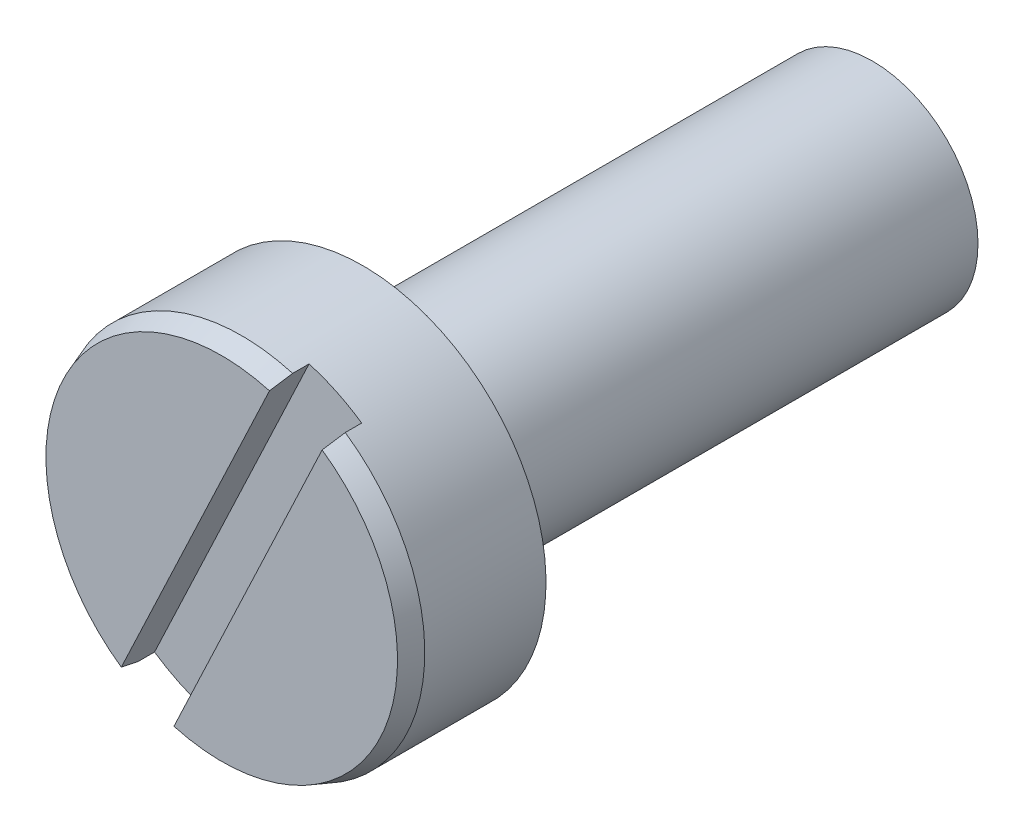
ISO-10303-21;
HEADER;
FILE_DESCRIPTION(('STEP AP214'),'2;1');
FILE_NAME('part.step','',(''),(''),'','','');
FILE_SCHEMA(('AUTOMOTIVE_DESIGN { 1 0 10303 214 1 1 1 1 }'));
ENDSEC;
DATA;
#1=APPLICATION_CONTEXT('core data for automotive mechanical design processes');
#2=APPLICATION_PROTOCOL_DEFINITION('international standard','automotive_design',2000,#1);
#3=PRODUCT_CONTEXT('',#1,'mechanical');
#4=PRODUCT('Part','Part','',(#3));
#5=PRODUCT_RELATED_PRODUCT_CATEGORY('part','',(#4));
#6=PRODUCT_DEFINITION_FORMATION('','',#4);
#7=PRODUCT_DEFINITION_CONTEXT('part definition',#1,'design');
#8=PRODUCT_DEFINITION('design','',#6,#7);
#9=PRODUCT_DEFINITION_SHAPE('','',#8);
#10=(LENGTH_UNIT() NAMED_UNIT(*) SI_UNIT(.MILLI.,.METRE.));
#11=(NAMED_UNIT(*) PLANE_ANGLE_UNIT() SI_UNIT($,.RADIAN.));
#12=(NAMED_UNIT(*) SI_UNIT($,.STERADIAN.) SOLID_ANGLE_UNIT());
#13=UNCERTAINTY_MEASURE_WITH_UNIT(LENGTH_MEASURE(1.E-05),#10,'distance_accuracy_value','');
#14=(GEOMETRIC_REPRESENTATION_CONTEXT(3) GLOBAL_UNCERTAINTY_ASSIGNED_CONTEXT((#13)) GLOBAL_UNIT_ASSIGNED_CONTEXT((#10,
#11,#12)) REPRESENTATION_CONTEXT('',''));
#15=CARTESIAN_POINT('',(0.,0.,0.));
#16=DIRECTION('',(0.,0.,1.));
#17=DIRECTION('',(1.,0.,0.));
#18=AXIS2_PLACEMENT_3D('',#15,#16,#17);
#19=CARTESIAN_POINT('',(15.2521980967912,-23.3190409170735,19.8000000000005));
#20=DIRECTION('',(0.,0.,-1.));
#21=DIRECTION('',(0.427457329703379,0.904035525453982,0.));
#22=AXIS2_PLACEMENT_3D('',#19,#20,#21);
#23=TOROIDAL_SURFACE('',#22,1.95,0.5);
#24=CARTESIAN_POINT('',(15.2521980967912,-23.3190409170735,19.8000000000005));
#25=DIRECTION('',(0.,0.,-1.));
#26=DIRECTION('',(0.427457329703379,0.904035525453982,0.));
#27=AXIS2_PLACEMENT_3D('',#24,#25,#26);
#28=CIRCLE('',#27,1.45);
#29=CARTESIAN_POINT('',(15.8720112248611,-22.0081894051652,19.8000000000005));
#30=VERTEX_POINT('',#29);
#31=EDGE_CURVE('E11',#30,#30,#28,.T.);
#32=ORIENTED_EDGE('',*,*,#31,.F.);
#33=EDGE_LOOP('',(#32));
#34=FACE_BOUND('',#33,.T.);
#35=CARTESIAN_POINT('',(15.2521980967912,-23.3190409170728,20.3000000000005));
#36=DIRECTION('',(0.,0.,1.));
#37=DIRECTION('',(0.427457329703379,0.904035525453982,0.));
#38=AXIS2_PLACEMENT_3D('',#35,#36,#37);
#39=CIRCLE('',#38,1.95);
#40=CARTESIAN_POINT('',(16.0857398897128,-21.5561716424375,20.3000000000005));
#41=VERTEX_POINT('',#40);
#42=EDGE_CURVE('E125',#41,#41,#39,.T.);
#43=ORIENTED_EDGE('',*,*,#42,.F.);
#44=EDGE_LOOP('',(#43));
#45=FACE_BOUND('',#44,.T.);
#46=ADVANCED_FACE('F17',(#34,#45),#23,.F.);
#47=CARTESIAN_POINT('',(15.2521980967912,-23.3190409170726,13.3000000000005));
#48=DIRECTION('',(0.,0.,1.));
#49=DIRECTION('',(-0.427457329703379,-0.904035525453982,0.));
#50=AXIS2_PLACEMENT_3D('',#47,#48,#49);
#51=CONICAL_SURFACE('',#50,1.175252258055,1.221730476396);
#52=CARTESIAN_POINT('',(15.2521980967912,-23.3190409170726,13.3000000000005));
#53=DIRECTION('',(0.,0.,-1.));
#54=DIRECTION('',(0.427457329703379,0.904035525453982,0.));
#55=AXIS2_PLACEMENT_3D('',#52,#53,#54);
#56=CIRCLE('',#55,1.175252258055);
#57=CARTESIAN_POINT('',(15.7545682887473,-22.2565711244209,13.3000000000005));
#58=VERTEX_POINT('',#57);
#59=EDGE_CURVE('E110',#58,#58,#56,.T.);
#60=ORIENTED_EDGE('',*,*,#59,.F.);
#61=EDGE_LOOP('',(#60));
#62=FACE_BOUND('',#61,.T.);
#63=CARTESIAN_POINT('',(15.2521980967912,-23.3190409170735,13.4000000000005));
#64=DIRECTION('',(0.,0.,1.));
#65=DIRECTION('',(0.427457329703379,0.904035525453982,0.));
#66=AXIS2_PLACEMENT_3D('',#63,#64,#65);
#67=CIRCLE('',#66,1.45);
#68=CARTESIAN_POINT('',(15.8720112248611,-22.0081894051652,13.4000000000005));
#69=VERTEX_POINT('',#68);
#70=EDGE_CURVE('E26',#69,#69,#67,.T.);
#71=ORIENTED_EDGE('',*,*,#70,.F.);
#72=EDGE_LOOP('',(#71));
#73=FACE_BOUND('',#72,.T.);
#74=ADVANCED_FACE('F181',(#62,#73),#51,.T.);
#75=CARTESIAN_POINT('',(15.2521980967912,-23.3190409170728,20.3000000000005));
#76=DIRECTION('',(0.,0.,1.));
#77=DIRECTION('',(-0.427457329703379,-0.904035525453982,0.));
#78=AXIS2_PLACEMENT_3D('',#75,#76,#77);
#79=CONICAL_SURFACE('',#78,2.240252258055,1.221730476396);
#80=CARTESIAN_POINT('',(15.2521980967912,-23.3190409170728,20.3000000000005));
#81=DIRECTION('',(0.,0.,-1.));
#82=DIRECTION('',(0.427457329703379,0.904035525453982,0.));
#83=AXIS2_PLACEMENT_3D('',#80,#81,#82);
#84=CIRCLE('',#83,2.240252258055);
#85=CARTESIAN_POINT('',(16.2098103448814,-21.2937732898126,20.3000000000005));
#86=VERTEX_POINT('',#85);
#87=EDGE_CURVE('E121',#86,#86,#84,.T.);
#88=ORIENTED_EDGE('',*,*,#87,.F.);
#89=EDGE_LOOP('',(#88));
#90=FACE_BOUND('',#89,.T.);
#91=CARTESIAN_POINT('',(15.2521980967912,-23.3190409170726,20.4000000000005));
#92=DIRECTION('',(0.,0.,1.));
#93=DIRECTION('',(0.427457329703379,0.904035525453982,0.));
#94=AXIS2_PLACEMENT_3D('',#91,#92,#93);
#95=CIRCLE('',#94,2.515);
#96=CARTESIAN_POINT('',(16.3272532809952,-21.0453915705559,20.4000000000005));
#97=VERTEX_POINT('',#96);
#98=EDGE_CURVE('E68',#97,#97,#95,.T.);
#99=ORIENTED_EDGE('',*,*,#98,.F.);
#100=EDGE_LOOP('',(#99));
#101=FACE_BOUND('',#100,.T.);
#102=ADVANCED_FACE('F186',(#90,#101),#79,.T.);
#103=CARTESIAN_POINT('',(15.2521980967912,-23.3190409170726,13.3000000000005));
#104=DIRECTION('',(0.,0.,-1.));
#105=DIRECTION('',(0.427457329703379,0.904035525453982,0.));
#106=AXIS2_PLACEMENT_3D('',#103,#104,#105);
#107=CYLINDRICAL_SURFACE('',#106,1.45);
#108=ORIENTED_EDGE('',*,*,#31,.T.);
#109=EDGE_LOOP('',(#108));
#110=FACE_BOUND('',#109,.T.);
#111=ORIENTED_EDGE('',*,*,#70,.T.);
#112=EDGE_LOOP('',(#111));
#113=FACE_BOUND('',#112,.T.);
#114=ADVANCED_FACE('F174',(#110,#113),#107,.T.);
#115=CARTESIAN_POINT('',(15.2521980967912,-23.3190409170726,13.3000000000005));
#116=DIRECTION('',(0.,0.,-1.));
#117=DIRECTION('',(0.427457329703379,0.904035525453982,0.));
#118=AXIS2_PLACEMENT_3D('',#115,#116,#117);
#119=CYLINDRICAL_SURFACE('',#118,2.515);
#120=CARTESIAN_POINT('',(15.2521980967912,-23.3190409170732,21.8400000000005));
#121=DIRECTION('',(0.,0.,-1.));
#122=DIRECTION('',(-0.427457329703369,-0.904035525453986,0.));
#123=AXIS2_PLACEMENT_3D('',#120,#121,#122);
#124=CIRCLE('',#123,2.515);
#125=CARTESIAN_POINT('',(14.5524412662482,-25.7347324077461,21.8400000000006));
#126=VERTEX_POINT('',#125);
#127=CARTESIAN_POINT('',(13.8292128458852,-25.3927665439834,21.8400000000006));
#128=VERTEX_POINT('',#127);
#129=EDGE_CURVE('E145',#126,#128,#124,.T.);
#130=ORIENTED_EDGE('',*,*,#129,.T.);
#131=DIRECTION('',(0.,0.,-1.));
#132=VECTOR('',#131,1.);
#133=CARTESIAN_POINT('',(13.8292128458852,-25.3927665439833,13.3000000000005));
#134=LINE('',#133,#132);
#135=CARTESIAN_POINT('',(13.8292128458852,-25.3927665439834,22.0652522580556));
#136=VERTEX_POINT('',#135);
#137=EDGE_CURVE('E64',#136,#128,#134,.T.);
#138=ORIENTED_EDGE('',*,*,#137,.F.);
#139=CARTESIAN_POINT('',(15.2521980967912,-23.3190409170731,22.0652522580555));
#140=DIRECTION('',(0.,0.,-1.));
#141=DIRECTION('',(-0.427457329703379,-0.904035525453982,0.));
#142=AXIS2_PLACEMENT_3D('',#139,#140,#141);
#143=CIRCLE('',#142,2.515);
#144=CARTESIAN_POINT('',(15.9519549273342,-20.9033494264002,22.0652522580556));
#145=VERTEX_POINT('',#144);
#146=EDGE_CURVE('E53',#136,#145,#143,.T.);
#147=ORIENTED_EDGE('',*,*,#146,.T.);
#148=DIRECTION('',(0.,0.,1.));
#149=VECTOR('',#148,1.);
#150=CARTESIAN_POINT('',(15.9519549273352,-20.9033494263997,13.3000000000005));
#151=LINE('',#150,#149);
#152=CARTESIAN_POINT('',(15.9519549273342,-20.9033494264003,21.8400000000006));
#153=VERTEX_POINT('',#152);
#154=EDGE_CURVE('E61',#153,#145,#151,.T.);
#155=ORIENTED_EDGE('',*,*,#154,.F.);
#156=CARTESIAN_POINT('',(15.2521980967912,-23.3190409170732,21.8400000000005));
#157=DIRECTION('',(0.,0.,-1.));
#158=DIRECTION('',(-0.427457329703379,-0.904035525453982,0.));
#159=AXIS2_PLACEMENT_3D('',#156,#157,#158);
#160=CIRCLE('',#159,2.515);
#161=CARTESIAN_POINT('',(16.6751833476982,-21.2453152901633,21.8400000000006));
#162=VERTEX_POINT('',#161);
#163=EDGE_CURVE('E93',#153,#162,#160,.T.);
#164=ORIENTED_EDGE('',*,*,#163,.T.);
#165=DIRECTION('',(0.,0.,-1.));
#166=VECTOR('',#165,1.);
#167=CARTESIAN_POINT('',(16.6751833476982,-21.2453152901627,13.3000000000005));
#168=LINE('',#167,#166);
#169=CARTESIAN_POINT('',(16.6751833476982,-21.2453152901632,22.0652522580556));
#170=VERTEX_POINT('',#169);
#171=EDGE_CURVE('E96',#170,#162,#168,.T.);
#172=ORIENTED_EDGE('',*,*,#171,.F.);
#173=CARTESIAN_POINT('',(14.5524412662482,-25.7347324077461,22.0652522580556));
#174=VERTEX_POINT('',#173);
#175=EDGE_CURVE('E106',#170,#174,#143,.T.);
#176=ORIENTED_EDGE('',*,*,#175,.T.);
#177=DIRECTION('',(0.,0.,1.));
#178=VECTOR('',#177,1.);
#179=CARTESIAN_POINT('',(14.5524412662482,-25.734732407746,13.3000000000005));
#180=LINE('',#179,#178);
#181=EDGE_CURVE('E103',#126,#174,#180,.T.);
#182=ORIENTED_EDGE('',*,*,#181,.F.);
#183=EDGE_LOOP('',(#130,#138,#147,#155,#164,#172,#176,#182));
#184=FACE_BOUND('',#183,.T.);
#185=ORIENTED_EDGE('',*,*,#98,.T.);
#186=EDGE_LOOP('',(#185));
#187=FACE_BOUND('',#186,.T.);
#188=ADVANCED_FACE('F56',(#184,#187),#119,.T.);
#189=CARTESIAN_POINT('',(15.2521980967912,-23.3190409170736,22.3400000000005));
#190=DIRECTION('',(0.,0.,1.));
#191=DIRECTION('',(-0.427457329703379,-0.904035525453982,0.));
#192=AXIS2_PLACEMENT_3D('',#189,#190,#191);
#193=PLANE('',#192);
#194=DIRECTION('',(-0.427457329703379,-0.904035525453982,0.));
#195=VECTOR('',#194,1.);
#196=CARTESIAN_POINT('',(13.5927342221062,-25.8928985151775,22.3400000000006));
#197=LINE('',#196,#195);
#198=CARTESIAN_POINT('',(15.9086347891252,-20.9949677966745,22.3400000000006));
#199=VERTEX_POINT('',#198);
#200=CARTESIAN_POINT('',(13.8725329840952,-25.3011481737088,22.3400000000005));
#201=VERTEX_POINT('',#200);
#202=EDGE_CURVE('E76',#199,#201,#197,.T.);
#203=ORIENTED_EDGE('',*,*,#202,.F.);
#204=CARTESIAN_POINT('',(15.2521980967912,-23.3190409170736,22.3400000000005));
#205=DIRECTION('',(0.,0.,1.));
#206=DIRECTION('',(-0.427457329703379,-0.904035525453982,0.));
#207=AXIS2_PLACEMENT_3D('',#204,#205,#206);
#208=CIRCLE('',#207,2.415);
#209=EDGE_CURVE('E36',#199,#201,#208,.T.);
#210=ORIENTED_EDGE('',*,*,#209,.T.);
#211=EDGE_LOOP('',(#203,#210));
#212=FACE_BOUND('',#211,.T.);
#213=ADVANCED_FACE('F163',(#212),#193,.T.);
#214=CARTESIAN_POINT('',(15.2521980967912,-23.3190409170731,22.0652522580555));
#215=DIRECTION('',(0.,0.,-1.));
#216=DIRECTION('',(0.427457329703379,0.904035525453982,0.));
#217=AXIS2_PLACEMENT_3D('',#214,#215,#216);
#218=CONICAL_SURFACE('',#217,2.515,0.349065850399);
#219=CARTESIAN_POINT('',(342.497732713185,669.712913971918,-261.393080578831));
#220=DIRECTION('',(0.904035525452299,-0.427457329706938,1.46077674032882E-12));
#221=DIRECTION('',(-0.401017918661995,-0.848118442749434,0.346236531839547));
#222=AXIS2_PLACEMENT_3D('',#219,#220,#221);
#223=CIRCLE('',#222,819.477595478914);
#224=EDGE_CURVE('E153',#201,#136,#223,.T.);
#225=ORIENTED_EDGE('',*,*,#224,.F.);
#226=ORIENTED_EDGE('',*,*,#209,.F.);
#227=CARTESIAN_POINT('',(-312.716562303543,-716.009024374547,-261.393078306499));
#228=DIRECTION('',(0.904035525453982,-0.427457329703379,0.));
#229=DIRECTION('',(0.401070781773213,0.848230243697522,0.345901260021795));
#230=AXIS2_PLACEMENT_3D('',#227,#228,#229);
#231=CIRCLE('',#230,819.477588912782);
#232=EDGE_CURVE('E71',#145,#199,#231,.T.);
#233=ORIENTED_EDGE('',*,*,#232,.F.);
#234=ORIENTED_EDGE('',*,*,#146,.F.);
#235=EDGE_LOOP('',(#225,#226,#233,#234));
#236=FACE_BOUND('',#235,.T.);
#237=ADVANCED_FACE('F72',(#236),#218,.T.);
#238=DIRECTION('',(0.427457329703379,0.904035525453982,0.));
#239=VECTOR('',#238,1.);
#240=CARTESIAN_POINT('',(14.3159626424702,-26.2348643789403,22.3400000000005));
#241=LINE('',#240,#239);
#242=CARTESIAN_POINT('',(14.5957614044582,-25.6431140374716,22.3400000000005));
#243=VERTEX_POINT('',#242);
#244=CARTESIAN_POINT('',(16.6318632094882,-21.3369336604376,22.3400000000006));
#245=VERTEX_POINT('',#244);
#246=EDGE_CURVE('E246',#243,#245,#241,.T.);
#247=ORIENTED_EDGE('',*,*,#246,.F.);
#248=EDGE_CURVE('E111',#243,#245,#208,.T.);
#249=ORIENTED_EDGE('',*,*,#248,.T.);
#250=EDGE_LOOP('',(#247,#249));
#251=FACE_BOUND('',#250,.T.);
#252=ADVANCED_FACE('F166',(#251),#193,.T.);
#253=CARTESIAN_POINT('',(17.5258474433082,-24.3940961012768,20.3000000000006));
#254=DIRECTION('',(0.,0.,-1.));
#255=DIRECTION('',(0.427457329703379,0.904035525453982,0.));
#256=AXIS2_PLACEMENT_3D('',#253,#254,#255);
#257=PLANE('',#256);
#258=ORIENTED_EDGE('',*,*,#42,.T.);
#259=EDGE_LOOP('',(#258));
#260=FACE_BOUND('',#259,.T.);
#261=ORIENTED_EDGE('',*,*,#87,.T.);
#262=EDGE_LOOP('',(#261));
#263=FACE_BOUND('',#262,.T.);
#264=ADVANCED_FACE('F178',(#260,#263),#257,.T.);
#265=CARTESIAN_POINT('',(16.5630496087002,-23.9388540451426,13.3000000000005));
#266=DIRECTION('',(0.,0.,-1.));
#267=DIRECTION('',(0.427457329703379,0.904035525453982,0.));
#268=AXIS2_PLACEMENT_3D('',#265,#266,#267);
#269=PLANE('',#268);
#270=ORIENTED_EDGE('',*,*,#59,.T.);
#271=EDGE_LOOP('',(#270));
#272=FACE_BOUND('',#271,.T.);
#273=ADVANCED_FACE('F208',(#272),#269,.T.);
#274=CARTESIAN_POINT('',(-311.993336519596,-716.350995806059,-261.393080578849));
#275=DIRECTION('',(-0.904035525452299,0.427457329706938,1.44341947337369E-12));
#276=DIRECTION('',(0.401017918661986,0.848118442749428,0.346236531839572));
#277=AXIS2_PLACEMENT_3D('',#274,#275,#276);
#278=CIRCLE('',#277,819.477595478914);
#279=EDGE_CURVE('E86',#245,#170,#278,.T.);
#280=ORIENTED_EDGE('',*,*,#279,.F.);
#281=ORIENTED_EDGE('',*,*,#248,.F.);
#282=CARTESIAN_POINT('',(343.220958497133,669.370942540406,-261.39307830648));
#283=DIRECTION('',(-0.904035525453982,0.427457329703379,0.));
#284=DIRECTION('',(-0.401070781773222,-0.848230243697527,0.345901260021773));
#285=AXIS2_PLACEMENT_3D('',#282,#283,#284);
#286=CIRCLE('',#285,819.477588912782);
#287=EDGE_CURVE('E115',#174,#243,#286,.T.);
#288=ORIENTED_EDGE('',*,*,#287,.F.);
#289=ORIENTED_EDGE('',*,*,#175,.F.);
#290=EDGE_LOOP('',(#280,#281,#288,#289));
#291=FACE_BOUND('',#290,.T.);
#292=ADVANCED_FACE('F173',(#291),#218,.T.);
#293=CARTESIAN_POINT('',(13.5927342221062,-25.8928985151775,21.8400000000006));
#294=DIRECTION('',(-0.904035525453982,0.427457329703379,0.));
#295=DIRECTION('',(-0.427457329703379,-0.904035525453982,0.));
#296=AXIS2_PLACEMENT_3D('',#293,#294,#295);
#297=PLANE('',#296);
#298=ORIENTED_EDGE('',*,*,#137,.T.);
#299=DIRECTION('',(-0.427457329703379,-0.904035525453982,0.));
#300=VECTOR('',#299,1.);
#301=CARTESIAN_POINT('',(13.5927342221062,-25.8928985151775,21.8400000000006));
#302=LINE('',#301,#300);
#303=EDGE_CURVE('E81',#153,#128,#302,.T.);
#304=ORIENTED_EDGE('',*,*,#303,.F.);
#305=ORIENTED_EDGE('',*,*,#154,.T.);
#306=ORIENTED_EDGE('',*,*,#232,.T.);
#307=ORIENTED_EDGE('',*,*,#202,.T.);
#308=ORIENTED_EDGE('',*,*,#224,.T.);
#309=EDGE_LOOP('',(#298,#304,#305,#306,#307,#308));
#310=FACE_BOUND('',#309,.T.);
#311=ADVANCED_FACE('F79',(#310),#297,.F.);
#312=CARTESIAN_POINT('',(14.3159626424702,-26.2348643789403,21.8400000000005));
#313=DIRECTION('',(0.904035525453982,-0.427457329703379,0.));
#314=DIRECTION('',(0.427457329703379,0.904035525453982,0.));
#315=AXIS2_PLACEMENT_3D('',#312,#313,#314);
#316=PLANE('',#315);
#317=ORIENTED_EDGE('',*,*,#171,.T.);
#318=DIRECTION('',(0.427457329703379,0.904035525453982,0.));
#319=VECTOR('',#318,1.);
#320=CARTESIAN_POINT('',(14.3159626424702,-26.2348643789403,21.8400000000005));
#321=LINE('',#320,#319);
#322=EDGE_CURVE('E97',#126,#162,#321,.T.);
#323=ORIENTED_EDGE('',*,*,#322,.F.);
#324=ORIENTED_EDGE('',*,*,#181,.T.);
#325=ORIENTED_EDGE('',*,*,#287,.T.);
#326=ORIENTED_EDGE('',*,*,#246,.T.);
#327=ORIENTED_EDGE('',*,*,#279,.T.);
#328=EDGE_LOOP('',(#317,#323,#324,#325,#326,#327));
#329=FACE_BOUND('',#328,.T.);
#330=ADVANCED_FACE('F217',(#329),#316,.F.);
#331=CARTESIAN_POINT('',(15.2521980967912,-23.3190409170732,21.8400000000005));
#332=DIRECTION('',(0.,0.,1.));
#333=DIRECTION('',(-0.427457329703379,-0.904035525453982,0.));
#334=AXIS2_PLACEMENT_3D('',#331,#332,#333);
#335=PLANE('',#334);
#336=ORIENTED_EDGE('',*,*,#303,.T.);
#337=ORIENTED_EDGE('',*,*,#129,.F.);
#338=ORIENTED_EDGE('',*,*,#322,.T.);
#339=ORIENTED_EDGE('',*,*,#163,.F.);
#340=EDGE_LOOP('',(#336,#337,#338,#339));
#341=FACE_BOUND('',#340,.T.);
#342=ADVANCED_FACE('F220',(#341),#335,.T.);
#343=CLOSED_SHELL('',(#46,#74,#102,#114,#188,#213,#237,#252,#264,#273,#292,#311,#330,#342));
#344=MANIFOLD_SOLID_BREP('B1',#343);
#345=ADVANCED_BREP_SHAPE_REPRESENTATION('',(#18,#344),#14);
#346=SHAPE_DEFINITION_REPRESENTATION(#9,#345);
ENDSEC;
END-ISO-10303-21;
